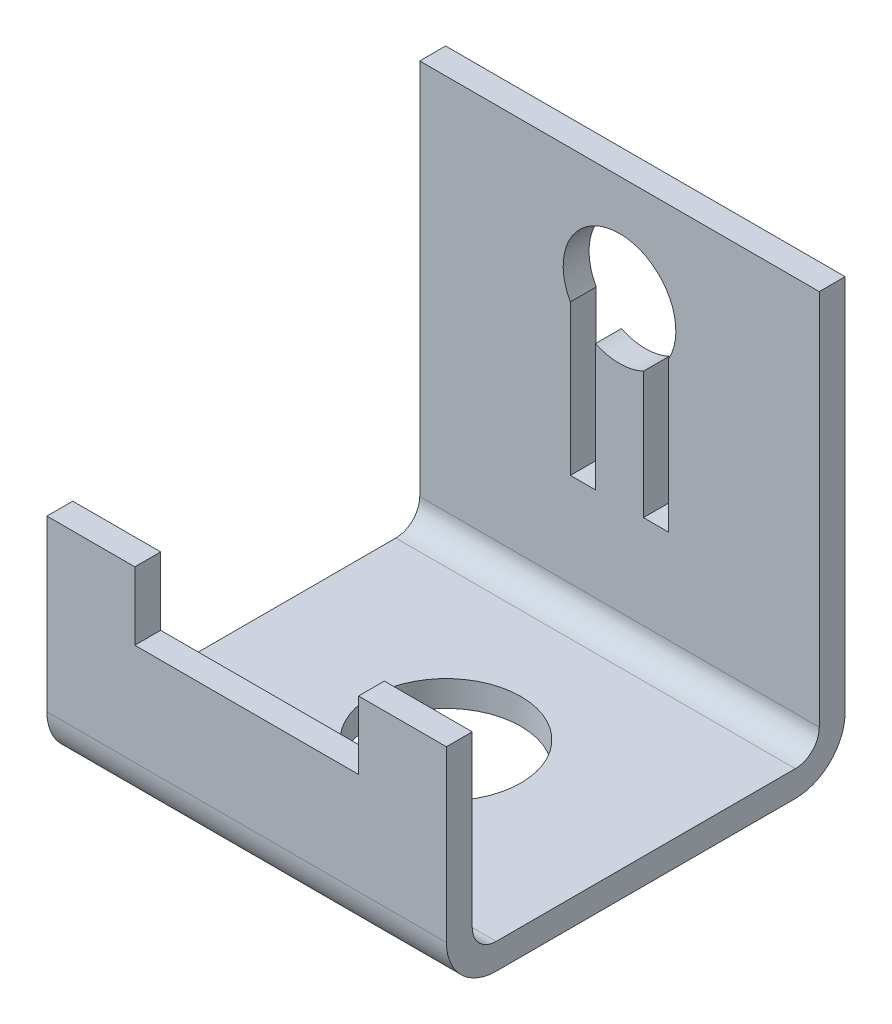
ISO-10303-21;
HEADER;
FILE_DESCRIPTION(('STEP AP214'),'2;1');
FILE_NAME('part.step','',(''),(''),'','','');
FILE_SCHEMA(('AUTOMOTIVE_DESIGN { 1 0 10303 214 1 1 1 1 }'));
ENDSEC;
DATA;
#1=APPLICATION_CONTEXT('core data for automotive mechanical design processes');
#2=APPLICATION_PROTOCOL_DEFINITION('international standard','automotive_design',2000,#1);
#3=PRODUCT_CONTEXT('',#1,'mechanical');
#4=PRODUCT('Part','Part','',(#3));
#5=PRODUCT_RELATED_PRODUCT_CATEGORY('part','',(#4));
#6=PRODUCT_DEFINITION_FORMATION('','',#4);
#7=PRODUCT_DEFINITION_CONTEXT('part definition',#1,'design');
#8=PRODUCT_DEFINITION('design','',#6,#7);
#9=PRODUCT_DEFINITION_SHAPE('','',#8);
#10=(LENGTH_UNIT() NAMED_UNIT(*) SI_UNIT(.MILLI.,.METRE.));
#11=(NAMED_UNIT(*) PLANE_ANGLE_UNIT() SI_UNIT($,.RADIAN.));
#12=(NAMED_UNIT(*) SI_UNIT($,.STERADIAN.) SOLID_ANGLE_UNIT());
#13=UNCERTAINTY_MEASURE_WITH_UNIT(LENGTH_MEASURE(1.E-05),#10,'distance_accuracy_value','');
#14=(GEOMETRIC_REPRESENTATION_CONTEXT(3) GLOBAL_UNCERTAINTY_ASSIGNED_CONTEXT((#13)) GLOBAL_UNIT_ASSIGNED_CONTEXT((#10,
#11,#12)) REPRESENTATION_CONTEXT('',''));
#15=CARTESIAN_POINT('',(0.,0.,0.));
#16=DIRECTION('',(0.,0.,1.));
#17=DIRECTION('',(1.,0.,0.));
#18=AXIS2_PLACEMENT_3D('',#15,#16,#17);
#19=CARTESIAN_POINT('',(0.,1.64338,0.));
#20=DIRECTION('',(0.,1.,0.));
#21=DIRECTION('',(0.,0.,1.));
#22=AXIS2_PLACEMENT_3D('',#19,#20,#21);
#23=PLANE('',#22);
#24=CARTESIAN_POINT('',(0.,1.64338,0.));
#25=DIRECTION('',(0.,1.,0.));
#26=DIRECTION('',(0.,0.,1.));
#27=AXIS2_PLACEMENT_3D('',#24,#25,#26);
#28=CIRCLE('',#27,4.7625);
#29=CARTESIAN_POINT('',(0.,1.64338,4.7625));
#30=VERTEX_POINT('',#29);
#31=EDGE_CURVE('E333',#30,#30,#28,.T.);
#32=ORIENTED_EDGE('',*,*,#31,.F.);
#33=EDGE_LOOP('',(#32));
#34=FACE_BOUND('',#33,.T.);
#35=DIRECTION('',(0.,0.,1.));
#36=VECTOR('',#35,1.);
#37=CARTESIAN_POINT('',(-12.7,1.64338,-12.6746));
#38=LINE('',#37,#36);
#39=CARTESIAN_POINT('',(-12.7,1.64338,-9.50722));
#40=VERTEX_POINT('',#39);
#41=CARTESIAN_POINT('',(-12.7,1.64338,9.50722));
#42=VERTEX_POINT('',#41);
#43=EDGE_CURVE('E339',#40,#42,#38,.T.);
#44=ORIENTED_EDGE('',*,*,#43,.T.);
#45=DIRECTION('',(-1.,0.,0.));
#46=VECTOR('',#45,1.);
#47=CARTESIAN_POINT('',(0.,1.64338,9.50722));
#48=LINE('',#47,#46);
#49=CARTESIAN_POINT('',(12.7,1.64338,9.50722));
#50=VERTEX_POINT('',#49);
#51=EDGE_CURVE('E366',#42,#50,#48,.F.);
#52=ORIENTED_EDGE('',*,*,#51,.T.);
#53=DIRECTION('',(0.,0.,-1.));
#54=VECTOR('',#53,1.);
#55=CARTESIAN_POINT('',(12.7,1.64338,-12.6746));
#56=LINE('',#55,#54);
#57=CARTESIAN_POINT('',(12.7,1.64338,-9.50722));
#58=VERTEX_POINT('',#57);
#59=EDGE_CURVE('E342',#50,#58,#56,.T.);
#60=ORIENTED_EDGE('',*,*,#59,.T.);
#61=DIRECTION('',(1.,0.,0.));
#62=VECTOR('',#61,1.);
#63=CARTESIAN_POINT('',(0.,1.64338,-9.50722));
#64=LINE('',#63,#62);
#65=EDGE_CURVE('E364',#58,#40,#64,.F.);
#66=ORIENTED_EDGE('',*,*,#65,.T.);
#67=EDGE_LOOP('',(#44,#52,#60,#66));
#68=FACE_BOUND('',#67,.T.);
#69=ADVANCED_FACE('F43',(#34,#68),#23,.T.);
#70=CARTESIAN_POINT('',(0.,9.6266,0.));
#71=DIRECTION('',(0.,-1.,0.));
#72=DIRECTION('',(0.,0.,-1.));
#73=AXIS2_PLACEMENT_3D('',#70,#71,#72);
#74=PLANE('',#73);
#75=DIRECTION('',(0.,0.,1.));
#76=VECTOR('',#75,1.);
#77=CARTESIAN_POINT('',(7.112,9.6266,12.6746));
#78=LINE('',#77,#76);
#79=CARTESIAN_POINT('',(7.112,9.6266,11.03122));
#80=VERTEX_POINT('',#79);
#81=CARTESIAN_POINT('',(7.112,9.6266,12.6746));
#82=VERTEX_POINT('',#81);
#83=EDGE_CURVE('E289',#80,#82,#78,.T.);
#84=ORIENTED_EDGE('',*,*,#83,.F.);
#85=DIRECTION('',(-1.,0.,0.));
#86=VECTOR('',#85,1.);
#87=CARTESIAN_POINT('',(-12.7,9.6266,11.03122));
#88=LINE('',#87,#86);
#89=CARTESIAN_POINT('',(-7.112,9.6266,11.03122));
#90=VERTEX_POINT('',#89);
#91=EDGE_CURVE('E324',#80,#90,#88,.T.);
#92=ORIENTED_EDGE('',*,*,#91,.T.);
#93=DIRECTION('',(0.,0.,-1.));
#94=VECTOR('',#93,1.);
#95=CARTESIAN_POINT('',(-7.112,9.6266,11.03122));
#96=LINE('',#95,#94);
#97=CARTESIAN_POINT('',(-7.112,9.6266,12.6746));
#98=VERTEX_POINT('',#97);
#99=EDGE_CURVE('E292',#98,#90,#96,.T.);
#100=ORIENTED_EDGE('',*,*,#99,.F.);
#101=DIRECTION('',(1.,0.,0.));
#102=VECTOR('',#101,1.);
#103=CARTESIAN_POINT('',(12.7,9.6266,12.6746));
#104=LINE('',#103,#102);
#105=EDGE_CURVE('E322',#98,#82,#104,.T.);
#106=ORIENTED_EDGE('',*,*,#105,.T.);
#107=EDGE_LOOP('',(#84,#92,#100,#106));
#108=FACE_BOUND('',#107,.T.);
#109=ADVANCED_FACE('F450',(#108),#74,.F.);
#110=CARTESIAN_POINT('',(0.,0.,0.));
#111=DIRECTION('',(0.,1.,0.));
#112=DIRECTION('',(0.,0.,1.));
#113=AXIS2_PLACEMENT_3D('',#110,#111,#112);
#114=PLANE('',#113);
#115=DIRECTION('',(0.,0.,1.));
#116=VECTOR('',#115,1.);
#117=CARTESIAN_POINT('',(-12.7,0.,-12.6746));
#118=LINE('',#117,#116);
#119=CARTESIAN_POINT('',(-12.7,0.,-9.50722));
#120=VERTEX_POINT('',#119);
#121=CARTESIAN_POINT('',(-12.7,0.,9.50722));
#122=VERTEX_POINT('',#121);
#123=EDGE_CURVE('E336',#120,#122,#118,.T.);
#124=ORIENTED_EDGE('',*,*,#123,.F.);
#125=DIRECTION('',(-1.,0.,0.));
#126=VECTOR('',#125,1.);
#127=CARTESIAN_POINT('',(0.,0.,-9.50722));
#128=LINE('',#127,#126);
#129=CARTESIAN_POINT('',(12.7,0.,-9.50722));
#130=VERTEX_POINT('',#129);
#131=EDGE_CURVE('E65',#120,#130,#128,.F.);
#132=ORIENTED_EDGE('',*,*,#131,.T.);
#133=DIRECTION('',(0.,0.,-1.));
#134=VECTOR('',#133,1.);
#135=CARTESIAN_POINT('',(12.7,0.,-12.6746));
#136=LINE('',#135,#134);
#137=CARTESIAN_POINT('',(12.7,0.,9.50722));
#138=VERTEX_POINT('',#137);
#139=EDGE_CURVE('E343',#138,#130,#136,.T.);
#140=ORIENTED_EDGE('',*,*,#139,.F.);
#141=DIRECTION('',(1.,0.,0.));
#142=VECTOR('',#141,1.);
#143=CARTESIAN_POINT('',(0.,0.,9.50722));
#144=LINE('',#143,#142);
#145=EDGE_CURVE('E386',#138,#122,#144,.F.);
#146=ORIENTED_EDGE('',*,*,#145,.T.);
#147=EDGE_LOOP('',(#124,#132,#140,#146));
#148=FACE_BOUND('',#147,.T.);
#149=CARTESIAN_POINT('',(0.,0.,0.));
#150=DIRECTION('',(0.,1.,0.));
#151=DIRECTION('',(0.,0.,1.));
#152=AXIS2_PLACEMENT_3D('',#149,#150,#151);
#153=CIRCLE('',#152,4.7625);
#154=CARTESIAN_POINT('',(0.,0.,4.7625));
#155=VERTEX_POINT('',#154);
#156=EDGE_CURVE('E332',#155,#155,#153,.T.);
#157=ORIENTED_EDGE('',*,*,#156,.T.);
#158=EDGE_LOOP('',(#157));
#159=FACE_BOUND('',#158,.T.);
#160=ADVANCED_FACE('F401',(#148,#159),#114,.F.);
#161=CARTESIAN_POINT('',(-12.7,1.64338,-12.6746));
#162=DIRECTION('',(1.,0.,0.));
#163=DIRECTION('',(0.,0.,-1.));
#164=AXIS2_PLACEMENT_3D('',#161,#162,#163);
#165=PLANE('',#164);
#166=DIRECTION('',(0.,-1.,0.));
#167=VECTOR('',#166,1.);
#168=CARTESIAN_POINT('',(-12.7,1.64338,-12.6746));
#169=LINE('',#168,#167);
#170=CARTESIAN_POINT('',(-12.7,27.1526,-12.6746));
#171=VERTEX_POINT('',#170);
#172=CARTESIAN_POINT('',(-12.7,3.16738,-12.6746));
#173=VERTEX_POINT('',#172);
#174=EDGE_CURVE('E346',#171,#173,#169,.T.);
#175=ORIENTED_EDGE('',*,*,#174,.T.);
#176=CARTESIAN_POINT('',(-12.7,3.16738,-9.50722));
#177=DIRECTION('',(1.,0.,0.));
#178=DIRECTION('',(0.,0.,-1.));
#179=AXIS2_PLACEMENT_3D('',#176,#177,#178);
#180=CIRCLE('',#179,3.16738);
#181=EDGE_CURVE('E384',#173,#120,#180,.F.);
#182=ORIENTED_EDGE('',*,*,#181,.T.);
#183=ORIENTED_EDGE('',*,*,#123,.T.);
#184=CARTESIAN_POINT('',(-12.7,3.16738,9.50722));
#185=DIRECTION('',(1.,0.,0.));
#186=DIRECTION('',(0.,0.,-1.));
#187=AXIS2_PLACEMENT_3D('',#184,#185,#186);
#188=CIRCLE('',#187,3.16738);
#189=CARTESIAN_POINT('',(-12.7,3.16738,12.6746));
#190=VERTEX_POINT('',#189);
#191=EDGE_CURVE('E382',#122,#190,#188,.F.);
#192=ORIENTED_EDGE('',*,*,#191,.T.);
#193=DIRECTION('',(0.,-1.,0.));
#194=VECTOR('',#193,1.);
#195=CARTESIAN_POINT('',(-12.7,1.64338,12.6746));
#196=LINE('',#195,#194);
#197=CARTESIAN_POINT('',(-12.7,13.9446,12.6746));
#198=VERTEX_POINT('',#197);
#199=EDGE_CURVE('E358',#198,#190,#196,.T.);
#200=ORIENTED_EDGE('',*,*,#199,.F.);
#201=DIRECTION('',(0.,0.,1.));
#202=VECTOR('',#201,1.);
#203=CARTESIAN_POINT('',(-12.7,13.9446,12.6746));
#204=LINE('',#203,#202);
#205=CARTESIAN_POINT('',(-12.7,13.9446,11.03122));
#206=VERTEX_POINT('',#205);
#207=EDGE_CURVE('E311',#206,#198,#204,.T.);
#208=ORIENTED_EDGE('',*,*,#207,.F.);
#209=DIRECTION('',(0.,-1.,0.));
#210=VECTOR('',#209,1.);
#211=CARTESIAN_POINT('',(-12.7,9.6266,11.03122));
#212=LINE('',#211,#210);
#213=CARTESIAN_POINT('',(-12.7,3.16738,11.03122));
#214=VERTEX_POINT('',#213);
#215=EDGE_CURVE('E326',#206,#214,#212,.T.);
#216=ORIENTED_EDGE('',*,*,#215,.T.);
#217=CARTESIAN_POINT('',(-12.7,3.16738,9.50722));
#218=DIRECTION('',(1.,0.,0.));
#219=DIRECTION('',(0.,0.,-1.));
#220=AXIS2_PLACEMENT_3D('',#217,#218,#219);
#221=CIRCLE('',#220,1.524);
#222=EDGE_CURVE('E371',#214,#42,#221,.T.);
#223=ORIENTED_EDGE('',*,*,#222,.T.);
#224=ORIENTED_EDGE('',*,*,#43,.F.);
#225=CARTESIAN_POINT('',(-12.7,3.16738,-9.50722));
#226=DIRECTION('',(1.,0.,0.));
#227=DIRECTION('',(0.,0.,-1.));
#228=AXIS2_PLACEMENT_3D('',#225,#226,#227);
#229=CIRCLE('',#228,1.524);
#230=CARTESIAN_POINT('',(-12.7,3.16738,-11.03122));
#231=VERTEX_POINT('',#230);
#232=EDGE_CURVE('E377',#40,#231,#229,.T.);
#233=ORIENTED_EDGE('',*,*,#232,.T.);
#234=DIRECTION('',(0.,-1.,0.));
#235=VECTOR('',#234,1.);
#236=CARTESIAN_POINT('',(-12.7,27.1526,-11.03122));
#237=LINE('',#236,#235);
#238=CARTESIAN_POINT('',(-12.7,27.1526,-11.03122));
#239=VERTEX_POINT('',#238);
#240=EDGE_CURVE('E279',#239,#231,#237,.T.);
#241=ORIENTED_EDGE('',*,*,#240,.F.);
#242=DIRECTION('',(0.,0.,1.));
#243=VECTOR('',#242,1.);
#244=CARTESIAN_POINT('',(-12.7,27.1526,-11.03122));
#245=LINE('',#244,#243);
#246=EDGE_CURVE('E264',#171,#239,#245,.T.);
#247=ORIENTED_EDGE('',*,*,#246,.F.);
#248=EDGE_LOOP('',(#175,#182,#183,#192,#200,#208,#216,#223,#224,#233,#241,#247));
#249=FACE_BOUND('',#248,.T.);
#250=ADVANCED_FACE('F398',(#249),#165,.F.);
#251=CARTESIAN_POINT('',(-12.7,1.64338,12.6746));
#252=DIRECTION('',(0.,0.,-1.));
#253=DIRECTION('',(-1.,0.,0.));
#254=AXIS2_PLACEMENT_3D('',#251,#252,#253);
#255=PLANE('',#254);
#256=ORIENTED_EDGE('',*,*,#199,.T.);
#257=DIRECTION('',(1.,0.,0.));
#258=VECTOR('',#257,1.);
#259=CARTESIAN_POINT('',(-12.7,3.16738,12.6746));
#260=LINE('',#259,#258);
#261=CARTESIAN_POINT('',(12.7,3.16738,12.6746));
#262=VERTEX_POINT('',#261);
#263=EDGE_CURVE('E11',#190,#262,#260,.T.);
#264=ORIENTED_EDGE('',*,*,#263,.T.);
#265=DIRECTION('',(0.,-1.,0.));
#266=VECTOR('',#265,1.);
#267=CARTESIAN_POINT('',(12.7,1.64338,12.6746));
#268=LINE('',#267,#266);
#269=CARTESIAN_POINT('',(12.7,13.9446,12.6746));
#270=VERTEX_POINT('',#269);
#271=EDGE_CURVE('E355',#270,#262,#268,.T.);
#272=ORIENTED_EDGE('',*,*,#271,.F.);
#273=DIRECTION('',(1.,0.,0.));
#274=VECTOR('',#273,1.);
#275=CARTESIAN_POINT('',(12.7,13.9446,12.6746));
#276=LINE('',#275,#274);
#277=CARTESIAN_POINT('',(7.112,13.9446,12.6746));
#278=VERTEX_POINT('',#277);
#279=EDGE_CURVE('E296',#278,#270,#276,.T.);
#280=ORIENTED_EDGE('',*,*,#279,.F.);
#281=DIRECTION('',(0.,-1.,0.));
#282=VECTOR('',#281,1.);
#283=CARTESIAN_POINT('',(7.112,13.9446,12.6746));
#284=LINE('',#283,#282);
#285=EDGE_CURVE('E285',#278,#82,#284,.T.);
#286=ORIENTED_EDGE('',*,*,#285,.T.);
#287=ORIENTED_EDGE('',*,*,#105,.F.);
#288=DIRECTION('',(0.,-1.,0.));
#289=VECTOR('',#288,1.);
#290=CARTESIAN_POINT('',(-7.112,13.9446,12.6746));
#291=LINE('',#290,#289);
#292=CARTESIAN_POINT('',(-7.112,13.9446,12.6746));
#293=VERTEX_POINT('',#292);
#294=EDGE_CURVE('E319',#293,#98,#291,.T.);
#295=ORIENTED_EDGE('',*,*,#294,.F.);
#296=DIRECTION('',(1.,0.,0.));
#297=VECTOR('',#296,1.);
#298=CARTESIAN_POINT('',(-7.112,13.9446,12.6746));
#299=LINE('',#298,#297);
#300=EDGE_CURVE('E303',#198,#293,#299,.T.);
#301=ORIENTED_EDGE('',*,*,#300,.F.);
#302=EDGE_LOOP('',(#256,#264,#272,#280,#286,#287,#295,#301));
#303=FACE_BOUND('',#302,.T.);
#304=ADVANCED_FACE('F406',(#303),#255,.F.);
#305=CARTESIAN_POINT('',(12.7,1.64338,-12.6746));
#306=DIRECTION('',(-1.,0.,0.));
#307=DIRECTION('',(0.,0.,1.));
#308=AXIS2_PLACEMENT_3D('',#305,#306,#307);
#309=PLANE('',#308);
#310=ORIENTED_EDGE('',*,*,#139,.T.);
#311=CARTESIAN_POINT('',(12.7,3.16738,-9.50722));
#312=DIRECTION('',(-1.,0.,0.));
#313=DIRECTION('',(0.,0.,1.));
#314=AXIS2_PLACEMENT_3D('',#311,#312,#313);
#315=CIRCLE('',#314,3.16738);
#316=CARTESIAN_POINT('',(12.7,3.16738,-12.6746));
#317=VERTEX_POINT('',#316);
#318=EDGE_CURVE('E51',#130,#317,#315,.F.);
#319=ORIENTED_EDGE('',*,*,#318,.T.);
#320=DIRECTION('',(0.,-1.,0.));
#321=VECTOR('',#320,1.);
#322=CARTESIAN_POINT('',(12.7,1.64338,-12.6746));
#323=LINE('',#322,#321);
#324=CARTESIAN_POINT('',(12.7,27.1526,-12.6746));
#325=VERTEX_POINT('',#324);
#326=EDGE_CURVE('E352',#325,#317,#323,.T.);
#327=ORIENTED_EDGE('',*,*,#326,.F.);
#328=DIRECTION('',(0.,0.,-1.));
#329=VECTOR('',#328,1.);
#330=CARTESIAN_POINT('',(12.7,27.1526,-12.6746));
#331=LINE('',#330,#329);
#332=CARTESIAN_POINT('',(12.7,27.1526,-11.03122));
#333=VERTEX_POINT('',#332);
#334=EDGE_CURVE('E270',#333,#325,#331,.T.);
#335=ORIENTED_EDGE('',*,*,#334,.F.);
#336=DIRECTION('',(0.,-1.,0.));
#337=VECTOR('',#336,1.);
#338=CARTESIAN_POINT('',(12.7,27.1526,-11.03122));
#339=LINE('',#338,#337);
#340=CARTESIAN_POINT('',(12.7,3.16738,-11.03122));
#341=VERTEX_POINT('',#340);
#342=EDGE_CURVE('E276',#333,#341,#339,.T.);
#343=ORIENTED_EDGE('',*,*,#342,.T.);
#344=CARTESIAN_POINT('',(12.7,3.16738,-9.50722));
#345=DIRECTION('',(-1.,0.,0.));
#346=DIRECTION('',(0.,0.,1.));
#347=AXIS2_PLACEMENT_3D('',#344,#345,#346);
#348=CIRCLE('',#347,1.524);
#349=EDGE_CURVE('E375',#341,#58,#348,.T.);
#350=ORIENTED_EDGE('',*,*,#349,.T.);
#351=ORIENTED_EDGE('',*,*,#59,.F.);
#352=CARTESIAN_POINT('',(12.7,3.16738,9.50722));
#353=DIRECTION('',(-1.,0.,0.));
#354=DIRECTION('',(0.,0.,1.));
#355=AXIS2_PLACEMENT_3D('',#352,#353,#354);
#356=CIRCLE('',#355,1.524);
#357=CARTESIAN_POINT('',(12.7,3.16738,11.03122));
#358=VERTEX_POINT('',#357);
#359=EDGE_CURVE('E373',#50,#358,#356,.T.);
#360=ORIENTED_EDGE('',*,*,#359,.T.);
#361=DIRECTION('',(0.,-1.,0.));
#362=VECTOR('',#361,1.);
#363=CARTESIAN_POINT('',(12.7,9.6266,11.03122));
#364=LINE('',#363,#362);
#365=CARTESIAN_POINT('',(12.7,13.9446,11.03122));
#366=VERTEX_POINT('',#365);
#367=EDGE_CURVE('E329',#366,#358,#364,.T.);
#368=ORIENTED_EDGE('',*,*,#367,.F.);
#369=DIRECTION('',(0.,0.,-1.));
#370=VECTOR('',#369,1.);
#371=CARTESIAN_POINT('',(12.7,13.9446,11.03122));
#372=LINE('',#371,#370);
#373=EDGE_CURVE('E288',#270,#366,#372,.T.);
#374=ORIENTED_EDGE('',*,*,#373,.F.);
#375=ORIENTED_EDGE('',*,*,#271,.T.);
#376=CARTESIAN_POINT('',(12.7,3.16738,9.50722));
#377=DIRECTION('',(-1.,0.,0.));
#378=DIRECTION('',(0.,0.,1.));
#379=AXIS2_PLACEMENT_3D('',#376,#377,#378);
#380=CIRCLE('',#379,3.16738);
#381=EDGE_CURVE('E58',#262,#138,#380,.F.);
#382=ORIENTED_EDGE('',*,*,#381,.T.);
#383=EDGE_LOOP('',(#310,#319,#327,#335,#343,#350,#351,#360,#368,#374,#375,#382));
#384=FACE_BOUND('',#383,.T.);
#385=ADVANCED_FACE('F391',(#384),#309,.F.);
#386=CARTESIAN_POINT('',(-12.7,1.64338,-12.6746));
#387=DIRECTION('',(0.,0.,1.));
#388=DIRECTION('',(1.,0.,0.));
#389=AXIS2_PLACEMENT_3D('',#386,#387,#388);
#390=PLANE('',#389);
#391=DIRECTION('',(0.,-1.,0.));
#392=VECTOR('',#391,1.);
#393=CARTESIAN_POINT('',(-1.524,9.1186,-12.6746));
#394=LINE('',#393,#392);
#395=CARTESIAN_POINT('',(-1.524,17.180635643516,-12.6746));
#396=VERTEX_POINT('',#395);
#397=CARTESIAN_POINT('',(-1.524,9.1186,-12.6746));
#398=VERTEX_POINT('',#397);
#399=EDGE_CURVE('E222',#396,#398,#394,.T.);
#400=ORIENTED_EDGE('',*,*,#399,.F.);
#401=CARTESIAN_POINT('',(0.,20.4216,-12.6746));
#402=DIRECTION('',(0.,0.,-1.));
#403=DIRECTION('',(-1.,0.,0.));
#404=AXIS2_PLACEMENT_3D('',#401,#402,#403);
#405=CIRCLE('',#404,3.5814);
#406=CARTESIAN_POINT('',(1.524,17.180635643516,-12.6746));
#407=VERTEX_POINT('',#406);
#408=EDGE_CURVE('E227',#407,#396,#405,.T.);
#409=ORIENTED_EDGE('',*,*,#408,.F.);
#410=DIRECTION('',(0.,1.,0.));
#411=VECTOR('',#410,1.);
#412=CARTESIAN_POINT('',(1.524,17.180635643516,-12.6746));
#413=LINE('',#412,#411);
#414=CARTESIAN_POINT('',(1.524,9.1186,-12.6746));
#415=VERTEX_POINT('',#414);
#416=EDGE_CURVE('E247',#415,#407,#413,.T.);
#417=ORIENTED_EDGE('',*,*,#416,.F.);
#418=DIRECTION('',(-1.,0.,0.));
#419=VECTOR('',#418,1.);
#420=CARTESIAN_POINT('',(1.524,9.1186,-12.6746));
#421=LINE('',#420,#419);
#422=CARTESIAN_POINT('',(3.1242,9.1186,-12.6746));
#423=VERTEX_POINT('',#422);
#424=EDGE_CURVE('E244',#423,#415,#421,.T.);
#425=ORIENTED_EDGE('',*,*,#424,.F.);
#426=DIRECTION('',(0.,-1.,0.));
#427=VECTOR('',#426,1.);
#428=CARTESIAN_POINT('',(3.1242,9.1186,-12.6746));
#429=LINE('',#428,#427);
#430=CARTESIAN_POINT('',(3.1242,18.6706573053352,-12.6746));
#431=VERTEX_POINT('',#430);
#432=EDGE_CURVE('E241',#431,#423,#429,.T.);
#433=ORIENTED_EDGE('',*,*,#432,.F.);
#434=CARTESIAN_POINT('',(0.,20.4216,-12.6746));
#435=DIRECTION('',(0.,0.,-1.));
#436=DIRECTION('',(-1.,0.,0.));
#437=AXIS2_PLACEMENT_3D('',#434,#435,#436);
#438=CIRCLE('',#437,3.5814);
#439=CARTESIAN_POINT('',(-3.1242,18.6706573053352,-12.6746));
#440=VERTEX_POINT('',#439);
#441=EDGE_CURVE('E235',#440,#431,#438,.T.);
#442=ORIENTED_EDGE('',*,*,#441,.F.);
#443=DIRECTION('',(0.,1.,0.));
#444=VECTOR('',#443,1.);
#445=CARTESIAN_POINT('',(-3.1242,18.6706573053352,-12.6746));
#446=LINE('',#445,#444);
#447=CARTESIAN_POINT('',(-3.1242,9.1186,-12.6746));
#448=VERTEX_POINT('',#447);
#449=EDGE_CURVE('E233',#448,#440,#446,.T.);
#450=ORIENTED_EDGE('',*,*,#449,.F.);
#451=DIRECTION('',(-1.,0.,0.));
#452=VECTOR('',#451,1.);
#453=CARTESIAN_POINT('',(-3.1242,9.1186,-12.6746));
#454=LINE('',#453,#452);
#455=EDGE_CURVE('E211',#398,#448,#454,.T.);
#456=ORIENTED_EDGE('',*,*,#455,.F.);
#457=EDGE_LOOP('',(#400,#409,#417,#425,#433,#442,#450,#456));
#458=FACE_BOUND('',#457,.T.);
#459=ORIENTED_EDGE('',*,*,#326,.T.);
#460=DIRECTION('',(-1.,0.,0.));
#461=VECTOR('',#460,1.);
#462=CARTESIAN_POINT('',(-12.7,3.16738,-12.6746));
#463=LINE('',#462,#461);
#464=EDGE_CURVE('E379',#317,#173,#463,.T.);
#465=ORIENTED_EDGE('',*,*,#464,.T.);
#466=ORIENTED_EDGE('',*,*,#174,.F.);
#467=DIRECTION('',(-1.,0.,0.));
#468=VECTOR('',#467,1.);
#469=CARTESIAN_POINT('',(-12.7,27.1526,-12.6746));
#470=LINE('',#469,#468);
#471=EDGE_CURVE('E273',#325,#171,#470,.T.);
#472=ORIENTED_EDGE('',*,*,#471,.F.);
#473=EDGE_LOOP('',(#459,#465,#466,#472));
#474=FACE_BOUND('',#473,.T.);
#475=ADVANCED_FACE('F229',(#458,#474),#390,.F.);
#476=CARTESIAN_POINT('',(0.,1.64338,0.));
#477=DIRECTION('',(0.,-1.,0.));
#478=DIRECTION('',(0.,0.,-1.));
#479=AXIS2_PLACEMENT_3D('',#476,#477,#478);
#480=CYLINDRICAL_SURFACE('',#479,4.7625);
#481=ORIENTED_EDGE('',*,*,#31,.T.);
#482=EDGE_LOOP('',(#481));
#483=FACE_BOUND('',#482,.T.);
#484=ORIENTED_EDGE('',*,*,#156,.F.);
#485=EDGE_LOOP('',(#484));
#486=FACE_BOUND('',#485,.T.);
#487=ADVANCED_FACE('F463',(#483,#486),#480,.F.);
#488=CARTESIAN_POINT('',(-12.7,9.6266,11.03122));
#489=DIRECTION('',(0.,0.,1.));
#490=DIRECTION('',(1.,0.,0.));
#491=AXIS2_PLACEMENT_3D('',#488,#489,#490);
#492=PLANE('',#491);
#493=ORIENTED_EDGE('',*,*,#367,.T.);
#494=DIRECTION('',(-1.,0.,0.));
#495=VECTOR('',#494,1.);
#496=CARTESIAN_POINT('',(-12.7,3.16738,11.03122));
#497=LINE('',#496,#495);
#498=EDGE_CURVE('E361',#358,#214,#497,.T.);
#499=ORIENTED_EDGE('',*,*,#498,.T.);
#500=ORIENTED_EDGE('',*,*,#215,.F.);
#501=DIRECTION('',(-1.,0.,0.));
#502=VECTOR('',#501,1.);
#503=CARTESIAN_POINT('',(-12.7,13.9446,11.03122));
#504=LINE('',#503,#502);
#505=CARTESIAN_POINT('',(-7.112,13.9446,11.03122));
#506=VERTEX_POINT('',#505);
#507=EDGE_CURVE('E308',#506,#206,#504,.T.);
#508=ORIENTED_EDGE('',*,*,#507,.F.);
#509=DIRECTION('',(0.,-1.,0.));
#510=VECTOR('',#509,1.);
#511=CARTESIAN_POINT('',(-7.112,13.9446,11.03122));
#512=LINE('',#511,#510);
#513=EDGE_CURVE('E314',#506,#90,#512,.T.);
#514=ORIENTED_EDGE('',*,*,#513,.T.);
#515=ORIENTED_EDGE('',*,*,#91,.F.);
#516=DIRECTION('',(0.,-1.,0.));
#517=VECTOR('',#516,1.);
#518=CARTESIAN_POINT('',(7.112,13.9446,11.03122));
#519=LINE('',#518,#517);
#520=CARTESIAN_POINT('',(7.112,13.9446,11.03122));
#521=VERTEX_POINT('',#520);
#522=EDGE_CURVE('E282',#521,#80,#519,.T.);
#523=ORIENTED_EDGE('',*,*,#522,.F.);
#524=DIRECTION('',(-1.,0.,0.));
#525=VECTOR('',#524,1.);
#526=CARTESIAN_POINT('',(7.112,13.9446,11.03122));
#527=LINE('',#526,#525);
#528=EDGE_CURVE('E293',#366,#521,#527,.T.);
#529=ORIENTED_EDGE('',*,*,#528,.F.);
#530=EDGE_LOOP('',(#493,#499,#500,#508,#514,#515,#523,#529));
#531=FACE_BOUND('',#530,.T.);
#532=ADVANCED_FACE('F415',(#531),#492,.F.);
#533=CARTESIAN_POINT('',(-7.112,13.9446,11.03122));
#534=DIRECTION('',(-1.,0.,0.));
#535=DIRECTION('',(0.,0.,1.));
#536=AXIS2_PLACEMENT_3D('',#533,#534,#535);
#537=PLANE('',#536);
#538=ORIENTED_EDGE('',*,*,#99,.T.);
#539=ORIENTED_EDGE('',*,*,#513,.F.);
#540=DIRECTION('',(0.,0.,-1.));
#541=VECTOR('',#540,1.);
#542=CARTESIAN_POINT('',(-7.112,13.9446,11.03122));
#543=LINE('',#542,#541);
#544=EDGE_CURVE('E306',#293,#506,#543,.T.);
#545=ORIENTED_EDGE('',*,*,#544,.F.);
#546=ORIENTED_EDGE('',*,*,#294,.T.);
#547=EDGE_LOOP('',(#538,#539,#545,#546));
#548=FACE_BOUND('',#547,.T.);
#549=ADVANCED_FACE('F642',(#548),#537,.F.);
#550=CARTESIAN_POINT('',(0.,13.9446,0.));
#551=DIRECTION('',(0.,-1.,0.));
#552=DIRECTION('',(0.,0.,-1.));
#553=AXIS2_PLACEMENT_3D('',#550,#551,#552);
#554=PLANE('',#553);
#555=ORIENTED_EDGE('',*,*,#300,.T.);
#556=ORIENTED_EDGE('',*,*,#544,.T.);
#557=ORIENTED_EDGE('',*,*,#507,.T.);
#558=ORIENTED_EDGE('',*,*,#207,.T.);
#559=EDGE_LOOP('',(#555,#556,#557,#558));
#560=FACE_BOUND('',#559,.T.);
#561=ADVANCED_FACE('F410',(#560),#554,.F.);
#562=CARTESIAN_POINT('',(7.112,13.9446,12.6746));
#563=DIRECTION('',(1.,0.,0.));
#564=DIRECTION('',(0.,0.,-1.));
#565=AXIS2_PLACEMENT_3D('',#562,#563,#564);
#566=PLANE('',#565);
#567=ORIENTED_EDGE('',*,*,#83,.T.);
#568=ORIENTED_EDGE('',*,*,#285,.F.);
#569=DIRECTION('',(0.,0.,1.));
#570=VECTOR('',#569,1.);
#571=CARTESIAN_POINT('',(7.112,13.9446,12.6746));
#572=LINE('',#571,#570);
#573=EDGE_CURVE('E299',#521,#278,#572,.T.);
#574=ORIENTED_EDGE('',*,*,#573,.F.);
#575=ORIENTED_EDGE('',*,*,#522,.T.);
#576=EDGE_LOOP('',(#567,#568,#574,#575));
#577=FACE_BOUND('',#576,.T.);
#578=ADVANCED_FACE('F623',(#577),#566,.F.);
#579=CARTESIAN_POINT('',(0.,13.9446,0.));
#580=DIRECTION('',(0.,-1.,0.));
#581=DIRECTION('',(0.,0.,-1.));
#582=AXIS2_PLACEMENT_3D('',#579,#580,#581);
#583=PLANE('',#582);
#584=ORIENTED_EDGE('',*,*,#528,.T.);
#585=ORIENTED_EDGE('',*,*,#573,.T.);
#586=ORIENTED_EDGE('',*,*,#279,.T.);
#587=ORIENTED_EDGE('',*,*,#373,.T.);
#588=EDGE_LOOP('',(#584,#585,#586,#587));
#589=FACE_BOUND('',#588,.T.);
#590=ADVANCED_FACE('F446',(#589),#583,.F.);
#591=CARTESIAN_POINT('',(12.7,27.1526,-11.03122));
#592=DIRECTION('',(0.,0.,-1.));
#593=DIRECTION('',(-1.,0.,0.));
#594=AXIS2_PLACEMENT_3D('',#591,#592,#593);
#595=PLANE('',#594);
#596=DIRECTION('',(0.,-1.,0.));
#597=VECTOR('',#596,1.);
#598=CARTESIAN_POINT('',(1.524,17.180635643516,-11.03122));
#599=LINE('',#598,#597);
#600=CARTESIAN_POINT('',(1.524,17.180635643516,-11.03122));
#601=VERTEX_POINT('',#600);
#602=CARTESIAN_POINT('',(1.524,9.1186,-11.03122));
#603=VERTEX_POINT('',#602);
#604=EDGE_CURVE('E719',#601,#603,#599,.T.);
#605=ORIENTED_EDGE('',*,*,#604,.F.);
#606=CARTESIAN_POINT('',(0.,20.4216,-11.03122));
#607=DIRECTION('',(0.,0.,-1.));
#608=DIRECTION('',(-1.,0.,0.));
#609=AXIS2_PLACEMENT_3D('',#606,#607,#608);
#610=CIRCLE('',#609,3.5814);
#611=CARTESIAN_POINT('',(-1.524,17.180635643516,-11.03122));
#612=VERTEX_POINT('',#611);
#613=EDGE_CURVE('E265',#612,#601,#610,.F.);
#614=ORIENTED_EDGE('',*,*,#613,.F.);
#615=DIRECTION('',(0.,1.,0.));
#616=VECTOR('',#615,1.);
#617=CARTESIAN_POINT('',(-1.524,9.1186,-11.03122));
#618=LINE('',#617,#616);
#619=CARTESIAN_POINT('',(-1.524,9.1186,-11.03122));
#620=VERTEX_POINT('',#619);
#621=EDGE_CURVE('E262',#620,#612,#618,.T.);
#622=ORIENTED_EDGE('',*,*,#621,.F.);
#623=DIRECTION('',(1.,0.,0.));
#624=VECTOR('',#623,1.);
#625=CARTESIAN_POINT('',(-3.1242,9.1186,-11.03122));
#626=LINE('',#625,#624);
#627=CARTESIAN_POINT('',(-3.1242,9.1186,-11.03122));
#628=VERTEX_POINT('',#627);
#629=EDGE_CURVE('E214',#628,#620,#626,.T.);
#630=ORIENTED_EDGE('',*,*,#629,.F.);
#631=DIRECTION('',(0.,-1.,0.));
#632=VECTOR('',#631,1.);
#633=CARTESIAN_POINT('',(-3.1242,18.6706573053352,-11.03122));
#634=LINE('',#633,#632);
#635=CARTESIAN_POINT('',(-3.1242,18.6706573053352,-11.03122));
#636=VERTEX_POINT('',#635);
#637=EDGE_CURVE('E740',#636,#628,#634,.T.);
#638=ORIENTED_EDGE('',*,*,#637,.F.);
#639=CARTESIAN_POINT('',(0.,20.4216,-11.03122));
#640=DIRECTION('',(0.,0.,-1.));
#641=DIRECTION('',(-1.,0.,0.));
#642=AXIS2_PLACEMENT_3D('',#639,#640,#641);
#643=CIRCLE('',#642,3.5814);
#644=CARTESIAN_POINT('',(3.1242,18.6706573053352,-11.03122));
#645=VERTEX_POINT('',#644);
#646=EDGE_CURVE('E732',#645,#636,#643,.F.);
#647=ORIENTED_EDGE('',*,*,#646,.F.);
#648=DIRECTION('',(0.,1.,0.));
#649=VECTOR('',#648,1.);
#650=CARTESIAN_POINT('',(3.1242,9.1186,-11.03122));
#651=LINE('',#650,#649);
#652=CARTESIAN_POINT('',(3.1242,9.1186,-11.03122));
#653=VERTEX_POINT('',#652);
#654=EDGE_CURVE('E730',#653,#645,#651,.T.);
#655=ORIENTED_EDGE('',*,*,#654,.F.);
#656=DIRECTION('',(1.,0.,0.));
#657=VECTOR('',#656,1.);
#658=CARTESIAN_POINT('',(1.524,9.1186,-11.03122));
#659=LINE('',#658,#657);
#660=EDGE_CURVE('E723',#603,#653,#659,.T.);
#661=ORIENTED_EDGE('',*,*,#660,.F.);
#662=EDGE_LOOP('',(#605,#614,#622,#630,#638,#647,#655,#661));
#663=FACE_BOUND('',#662,.T.);
#664=ORIENTED_EDGE('',*,*,#240,.T.);
#665=DIRECTION('',(1.,0.,0.));
#666=VECTOR('',#665,1.);
#667=CARTESIAN_POINT('',(12.7,3.16738,-11.03122));
#668=LINE('',#667,#666);
#669=EDGE_CURVE('E368',#231,#341,#668,.T.);
#670=ORIENTED_EDGE('',*,*,#669,.T.);
#671=ORIENTED_EDGE('',*,*,#342,.F.);
#672=DIRECTION('',(1.,0.,0.));
#673=VECTOR('',#672,1.);
#674=CARTESIAN_POINT('',(12.7,27.1526,-11.03122));
#675=LINE('',#674,#673);
#676=EDGE_CURVE('E268',#239,#333,#675,.T.);
#677=ORIENTED_EDGE('',*,*,#676,.F.);
#678=EDGE_LOOP('',(#664,#670,#671,#677));
#679=FACE_BOUND('',#678,.T.);
#680=ADVANCED_FACE('F431',(#663,#679),#595,.F.);
#681=CARTESIAN_POINT('',(0.,27.1526,0.));
#682=DIRECTION('',(0.,-1.,0.));
#683=DIRECTION('',(0.,0.,-1.));
#684=AXIS2_PLACEMENT_3D('',#681,#682,#683);
#685=PLANE('',#684);
#686=ORIENTED_EDGE('',*,*,#246,.T.);
#687=ORIENTED_EDGE('',*,*,#676,.T.);
#688=ORIENTED_EDGE('',*,*,#334,.T.);
#689=ORIENTED_EDGE('',*,*,#471,.T.);
#690=EDGE_LOOP('',(#686,#687,#688,#689));
#691=FACE_BOUND('',#690,.T.);
#692=ADVANCED_FACE('F434',(#691),#685,.F.);
#693=CARTESIAN_POINT('',(0.,20.4216,5.48698411546001));
#694=DIRECTION('',(0.,0.,-1.));
#695=DIRECTION('',(-1.,0.,0.));
#696=AXIS2_PLACEMENT_3D('',#693,#694,#695);
#697=CYLINDRICAL_SURFACE('',#696,3.5814);
#698=ORIENTED_EDGE('',*,*,#613,.T.);
#699=DIRECTION('',(0.,0.,-1.));
#700=VECTOR('',#699,1.);
#701=CARTESIAN_POINT('',(1.524,17.180635643516,5.48698411546001));
#702=LINE('',#701,#700);
#703=EDGE_CURVE('E250',#601,#407,#702,.T.);
#704=ORIENTED_EDGE('',*,*,#703,.T.);
#705=ORIENTED_EDGE('',*,*,#408,.T.);
#706=DIRECTION('',(0.,0.,-1.));
#707=VECTOR('',#706,1.);
#708=CARTESIAN_POINT('',(-1.524,17.180635643516,5.48698411546001));
#709=LINE('',#708,#707);
#710=EDGE_CURVE('E218',#612,#396,#709,.T.);
#711=ORIENTED_EDGE('',*,*,#710,.F.);
#712=EDGE_LOOP('',(#698,#704,#705,#711));
#713=FACE_BOUND('',#712,.T.);
#714=ADVANCED_FACE('F436',(#713),#697,.F.);
#715=CARTESIAN_POINT('',(1.524,17.180635643516,5.48698411546001));
#716=DIRECTION('',(-1.,0.,0.));
#717=DIRECTION('',(0.,-1.,0.));
#718=AXIS2_PLACEMENT_3D('',#715,#716,#717);
#719=PLANE('',#718);
#720=ORIENTED_EDGE('',*,*,#604,.T.);
#721=DIRECTION('',(0.,0.,-1.));
#722=VECTOR('',#721,1.);
#723=CARTESIAN_POINT('',(1.524,9.1186,5.48698411546001));
#724=LINE('',#723,#722);
#725=EDGE_CURVE('E252',#603,#415,#724,.T.);
#726=ORIENTED_EDGE('',*,*,#725,.T.);
#727=ORIENTED_EDGE('',*,*,#416,.T.);
#728=ORIENTED_EDGE('',*,*,#703,.F.);
#729=EDGE_LOOP('',(#720,#726,#727,#728));
#730=FACE_BOUND('',#729,.T.);
#731=ADVANCED_FACE('F442',(#730),#719,.F.);
#732=CARTESIAN_POINT('',(1.524,9.1186,5.48698411546001));
#733=DIRECTION('',(0.,-1.,0.));
#734=DIRECTION('',(0.,0.,-1.));
#735=AXIS2_PLACEMENT_3D('',#732,#733,#734);
#736=PLANE('',#735);
#737=ORIENTED_EDGE('',*,*,#660,.T.);
#738=DIRECTION('',(0.,0.,-1.));
#739=VECTOR('',#738,1.);
#740=CARTESIAN_POINT('',(3.1242,9.1186,5.48698411546001));
#741=LINE('',#740,#739);
#742=EDGE_CURVE('E254',#653,#423,#741,.T.);
#743=ORIENTED_EDGE('',*,*,#742,.T.);
#744=ORIENTED_EDGE('',*,*,#424,.T.);
#745=ORIENTED_EDGE('',*,*,#725,.F.);
#746=EDGE_LOOP('',(#737,#743,#744,#745));
#747=FACE_BOUND('',#746,.T.);
#748=ADVANCED_FACE('F546',(#747),#736,.F.);
#749=CARTESIAN_POINT('',(3.1242,9.1186,5.48698411546001));
#750=DIRECTION('',(1.,0.,0.));
#751=DIRECTION('',(0.,1.,0.));
#752=AXIS2_PLACEMENT_3D('',#749,#750,#751);
#753=PLANE('',#752);
#754=ORIENTED_EDGE('',*,*,#654,.T.);
#755=DIRECTION('',(0.,0.,-1.));
#756=VECTOR('',#755,1.);
#757=CARTESIAN_POINT('',(3.1242,18.6706573053352,5.48698411546001));
#758=LINE('',#757,#756);
#759=EDGE_CURVE('E256',#645,#431,#758,.T.);
#760=ORIENTED_EDGE('',*,*,#759,.T.);
#761=ORIENTED_EDGE('',*,*,#432,.T.);
#762=ORIENTED_EDGE('',*,*,#742,.F.);
#763=EDGE_LOOP('',(#754,#760,#761,#762));
#764=FACE_BOUND('',#763,.T.);
#765=ADVANCED_FACE('F536',(#764),#753,.F.);
#766=CARTESIAN_POINT('',(0.,20.4216,5.48698411546001));
#767=DIRECTION('',(0.,0.,-1.));
#768=DIRECTION('',(-1.,0.,0.));
#769=AXIS2_PLACEMENT_3D('',#766,#767,#768);
#770=CYLINDRICAL_SURFACE('',#769,3.5814);
#771=ORIENTED_EDGE('',*,*,#646,.T.);
#772=DIRECTION('',(0.,0.,-1.));
#773=VECTOR('',#772,1.);
#774=CARTESIAN_POINT('',(-3.1242,18.6706573053352,5.48698411546001));
#775=LINE('',#774,#773);
#776=EDGE_CURVE('E258',#636,#440,#775,.T.);
#777=ORIENTED_EDGE('',*,*,#776,.T.);
#778=ORIENTED_EDGE('',*,*,#441,.T.);
#779=ORIENTED_EDGE('',*,*,#759,.F.);
#780=EDGE_LOOP('',(#771,#777,#778,#779));
#781=FACE_BOUND('',#780,.T.);
#782=ADVANCED_FACE('F526',(#781),#770,.F.);
#783=CARTESIAN_POINT('',(-3.1242,18.6706573053352,5.48698411546001));
#784=DIRECTION('',(-1.,0.,0.));
#785=DIRECTION('',(0.,-1.,0.));
#786=AXIS2_PLACEMENT_3D('',#783,#784,#785);
#787=PLANE('',#786);
#788=ORIENTED_EDGE('',*,*,#637,.T.);
#789=DIRECTION('',(0.,0.,-1.));
#790=VECTOR('',#789,1.);
#791=CARTESIAN_POINT('',(-3.1242,9.1186,5.48698411546001));
#792=LINE('',#791,#790);
#793=EDGE_CURVE('E217',#628,#448,#792,.T.);
#794=ORIENTED_EDGE('',*,*,#793,.T.);
#795=ORIENTED_EDGE('',*,*,#449,.T.);
#796=ORIENTED_EDGE('',*,*,#776,.F.);
#797=EDGE_LOOP('',(#788,#794,#795,#796));
#798=FACE_BOUND('',#797,.T.);
#799=ADVANCED_FACE('F517',(#798),#787,.F.);
#800=CARTESIAN_POINT('',(-3.1242,9.1186,5.48698411546001));
#801=DIRECTION('',(0.,-1.,0.));
#802=DIRECTION('',(0.,0.,-1.));
#803=AXIS2_PLACEMENT_3D('',#800,#801,#802);
#804=PLANE('',#803);
#805=ORIENTED_EDGE('',*,*,#629,.T.);
#806=DIRECTION('',(0.,0.,-1.));
#807=VECTOR('',#806,1.);
#808=CARTESIAN_POINT('',(-1.524,9.1186,5.48698411546001));
#809=LINE('',#808,#807);
#810=EDGE_CURVE('E206',#620,#398,#809,.T.);
#811=ORIENTED_EDGE('',*,*,#810,.T.);
#812=ORIENTED_EDGE('',*,*,#455,.T.);
#813=ORIENTED_EDGE('',*,*,#793,.F.);
#814=EDGE_LOOP('',(#805,#811,#812,#813));
#815=FACE_BOUND('',#814,.T.);
#816=ADVANCED_FACE('F208',(#815),#804,.F.);
#817=CARTESIAN_POINT('',(-1.524,9.1186,5.48698411546001));
#818=DIRECTION('',(1.,0.,0.));
#819=DIRECTION('',(0.,1.,0.));
#820=AXIS2_PLACEMENT_3D('',#817,#818,#819);
#821=PLANE('',#820);
#822=ORIENTED_EDGE('',*,*,#621,.T.);
#823=ORIENTED_EDGE('',*,*,#710,.T.);
#824=ORIENTED_EDGE('',*,*,#399,.T.);
#825=ORIENTED_EDGE('',*,*,#810,.F.);
#826=EDGE_LOOP('',(#822,#823,#824,#825));
#827=FACE_BOUND('',#826,.T.);
#828=ADVANCED_FACE('F223',(#827),#821,.F.);
#829=CARTESIAN_POINT('',(-12.7,3.16738,9.50722));
#830=DIRECTION('',(-1.,0.,0.));
#831=DIRECTION('',(0.,0.,1.));
#832=AXIS2_PLACEMENT_3D('',#829,#830,#831);
#833=CYLINDRICAL_SURFACE('',#832,1.524);
#834=ORIENTED_EDGE('',*,*,#359,.F.);
#835=ORIENTED_EDGE('',*,*,#51,.F.);
#836=ORIENTED_EDGE('',*,*,#222,.F.);
#837=ORIENTED_EDGE('',*,*,#498,.F.);
#838=EDGE_LOOP('',(#834,#835,#836,#837));
#839=FACE_BOUND('',#838,.T.);
#840=ADVANCED_FACE('F420',(#839),#833,.F.);
#841=CARTESIAN_POINT('',(12.7,3.16738,-9.50722));
#842=DIRECTION('',(1.,0.,0.));
#843=DIRECTION('',(0.,0.,-1.));
#844=AXIS2_PLACEMENT_3D('',#841,#842,#843);
#845=CYLINDRICAL_SURFACE('',#844,1.524);
#846=ORIENTED_EDGE('',*,*,#232,.F.);
#847=ORIENTED_EDGE('',*,*,#65,.F.);
#848=ORIENTED_EDGE('',*,*,#349,.F.);
#849=ORIENTED_EDGE('',*,*,#669,.F.);
#850=EDGE_LOOP('',(#846,#847,#848,#849));
#851=FACE_BOUND('',#850,.T.);
#852=ADVANCED_FACE('F429',(#851),#845,.F.);
#853=CARTESIAN_POINT('',(-12.7,3.16738,-9.50722));
#854=DIRECTION('',(-1.,0.,0.));
#855=DIRECTION('',(0.,0.,1.));
#856=AXIS2_PLACEMENT_3D('',#853,#854,#855);
#857=CYLINDRICAL_SURFACE('',#856,3.16738);
#858=ORIENTED_EDGE('',*,*,#318,.F.);
#859=ORIENTED_EDGE('',*,*,#131,.F.);
#860=ORIENTED_EDGE('',*,*,#181,.F.);
#861=ORIENTED_EDGE('',*,*,#464,.F.);
#862=EDGE_LOOP('',(#858,#859,#860,#861));
#863=FACE_BOUND('',#862,.T.);
#864=ADVANCED_FACE('F396',(#863),#857,.T.);
#865=CARTESIAN_POINT('',(-12.7,3.16738,9.50722));
#866=DIRECTION('',(1.,0.,0.));
#867=DIRECTION('',(0.,0.,-1.));
#868=AXIS2_PLACEMENT_3D('',#865,#866,#867);
#869=CYLINDRICAL_SURFACE('',#868,3.16738);
#870=ORIENTED_EDGE('',*,*,#191,.F.);
#871=ORIENTED_EDGE('',*,*,#145,.F.);
#872=ORIENTED_EDGE('',*,*,#381,.F.);
#873=ORIENTED_EDGE('',*,*,#263,.F.);
#874=EDGE_LOOP('',(#870,#871,#872,#873));
#875=FACE_BOUND('',#874,.T.);
#876=ADVANCED_FACE('F45',(#875),#869,.T.);
#877=CLOSED_SHELL('',(#69,#109,#160,#250,#304,#385,#475,#487,#532,#549,#561,#578,#590,#680,#692,
#714,#731,#748,#765,#782,#799,#816,#828,#840,#852,#864,#876));
#878=MANIFOLD_SOLID_BREP('B2',#877);
#879=ADVANCED_BREP_SHAPE_REPRESENTATION('',(#18,#878),#14);
#880=SHAPE_DEFINITION_REPRESENTATION(#9,#879);
ENDSEC;
END-ISO-10303-21;
